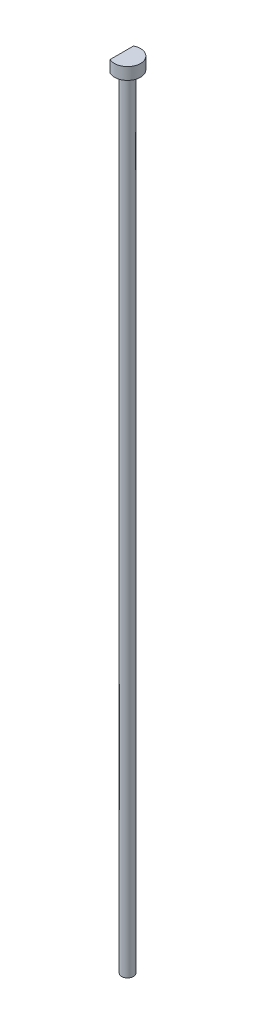
ISO-10303-21;
HEADER;
FILE_DESCRIPTION(('STEP AP214'),'2;1');
FILE_NAME('part.step','',(''),(''),'','','');
FILE_SCHEMA(('AUTOMOTIVE_DESIGN { 1 0 10303 214 1 1 1 1 }'));
ENDSEC;
DATA;
#1=APPLICATION_CONTEXT('core data for automotive mechanical design processes');
#2=APPLICATION_PROTOCOL_DEFINITION('international standard','automotive_design',2000,#1);
#3=PRODUCT_CONTEXT('',#1,'mechanical');
#4=PRODUCT('Part','Part','',(#3));
#5=PRODUCT_RELATED_PRODUCT_CATEGORY('part','',(#4));
#6=PRODUCT_DEFINITION_FORMATION('','',#4);
#7=PRODUCT_DEFINITION_CONTEXT('part definition',#1,'design');
#8=PRODUCT_DEFINITION('design','',#6,#7);
#9=PRODUCT_DEFINITION_SHAPE('','',#8);
#10=(LENGTH_UNIT() NAMED_UNIT(*) SI_UNIT(.MILLI.,.METRE.));
#11=(NAMED_UNIT(*) PLANE_ANGLE_UNIT() SI_UNIT($,.RADIAN.));
#12=(NAMED_UNIT(*) SI_UNIT($,.STERADIAN.) SOLID_ANGLE_UNIT());
#13=UNCERTAINTY_MEASURE_WITH_UNIT(LENGTH_MEASURE(1.E-05),#10,'distance_accuracy_value','');
#14=(GEOMETRIC_REPRESENTATION_CONTEXT(3) GLOBAL_UNCERTAINTY_ASSIGNED_CONTEXT((#13)) GLOBAL_UNIT_ASSIGNED_CONTEXT((#10,
#11,#12)) REPRESENTATION_CONTEXT('',''));
#15=CARTESIAN_POINT('',(0.,0.,0.));
#16=DIRECTION('',(0.,0.,1.));
#17=DIRECTION('',(1.,0.,0.));
#18=AXIS2_PLACEMENT_3D('',#15,#16,#17);
#19=CARTESIAN_POINT('',(74.9720896996677,-2.,-66.1181306724391));
#20=DIRECTION('',(0.,1.,0.));
#21=DIRECTION('',(0.,0.,1.));
#22=AXIS2_PLACEMENT_3D('',#19,#20,#21);
#23=PLANE('',#22);
#24=DIRECTION('',(0.,0.,1.));
#25=VECTOR('',#24,1.);
#26=CARTESIAN_POINT('',(71.0780888071205,-2.,-70.9771390194246));
#27=LINE('',#26,#25);
#28=CARTESIAN_POINT('',(71.0780888071205,-2.,-61.2591223254536));
#29=VERTEX_POINT('',#28);
#30=CARTESIAN_POINT('',(71.0780888071205,-2.,-70.9771390194246));
#31=VERTEX_POINT('',#30);
#32=EDGE_CURVE('E64',#29,#31,#27,.F.);
#33=ORIENTED_EDGE('',*,*,#32,.F.);
#34=CARTESIAN_POINT('',(73.4562989507967,-2.,-66.1181306724391));
#35=DIRECTION('',(0.,1.,0.));
#36=DIRECTION('',(0.,0.,1.));
#37=AXIS2_PLACEMENT_3D('',#34,#35,#36);
#38=CIRCLE('',#37,5.40979164141828);
#39=EDGE_CURVE('E19',#31,#29,#38,.F.);
#40=ORIENTED_EDGE('',*,*,#39,.F.);
#41=EDGE_LOOP('',(#33,#40));
#42=FACE_BOUND('',#41,.T.);
#43=ADVANCED_FACE('F16',(#42),#23,.T.);
#44=CARTESIAN_POINT('',(73.4562989507967,-7.,-66.1181306724391));
#45=DIRECTION('',(0.,1.,0.));
#46=DIRECTION('',(0.,0.,1.));
#47=AXIS2_PLACEMENT_3D('',#44,#45,#46);
#48=CYLINDRICAL_SURFACE('',#47,5.40979164141828);
#49=ORIENTED_EDGE('',*,*,#39,.T.);
#50=DIRECTION('',(0.,1.,0.));
#51=VECTOR('',#50,1.);
#52=CARTESIAN_POINT('',(71.0780888071205,-7.,-61.2591223254536));
#53=LINE('',#52,#51);
#54=CARTESIAN_POINT('',(71.0780888071205,-7.,-61.2591223254536));
#55=VERTEX_POINT('',#54);
#56=EDGE_CURVE('E58',#55,#29,#53,.T.);
#57=ORIENTED_EDGE('',*,*,#56,.F.);
#58=CARTESIAN_POINT('',(73.4562989507967,-7.,-66.1181306724391));
#59=DIRECTION('',(0.,1.,0.));
#60=DIRECTION('',(0.,0.,1.));
#61=AXIS2_PLACEMENT_3D('',#58,#59,#60);
#62=CIRCLE('',#61,5.40979164141828);
#63=CARTESIAN_POINT('',(71.0780888071205,-7.,-70.9771390194246));
#64=VERTEX_POINT('',#63);
#65=EDGE_CURVE('E63',#55,#64,#62,.T.);
#66=ORIENTED_EDGE('',*,*,#65,.T.);
#67=DIRECTION('',(0.,1.,0.));
#68=VECTOR('',#67,1.);
#69=CARTESIAN_POINT('',(71.0780888071205,-7.,-70.9771390194246));
#70=LINE('',#69,#68);
#71=EDGE_CURVE('E61',#31,#64,#70,.F.);
#72=ORIENTED_EDGE('',*,*,#71,.F.);
#73=EDGE_LOOP('',(#49,#57,#66,#72));
#74=FACE_BOUND('',#73,.T.);
#75=ADVANCED_FACE('F56',(#74),#48,.T.);
#76=CARTESIAN_POINT('',(74.9720896996677,-7.,-66.1181306724391));
#77=DIRECTION('',(0.,1.,0.));
#78=DIRECTION('',(0.,0.,1.));
#79=AXIS2_PLACEMENT_3D('',#76,#77,#78);
#80=PLANE('',#79);
#81=DIRECTION('',(0.,0.,1.));
#82=VECTOR('',#81,1.);
#83=CARTESIAN_POINT('',(71.0780888071205,-7.,-70.9771390194246));
#84=LINE('',#83,#82);
#85=CARTESIAN_POINT('',(71.0780888071205,-7.,-66.7089493946506));
#86=VERTEX_POINT('',#85);
#87=EDGE_CURVE('E73',#64,#86,#84,.T.);
#88=ORIENTED_EDGE('',*,*,#87,.F.);
#89=ORIENTED_EDGE('',*,*,#65,.F.);
#90=DIRECTION('',(0.,0.,1.));
#91=VECTOR('',#90,1.);
#92=CARTESIAN_POINT('',(71.0780888071205,-7.,-70.9771390194246));
#93=LINE('',#92,#91);
#94=CARTESIAN_POINT('',(71.0780888071205,-7.,-65.5273119502276));
#95=VERTEX_POINT('',#94);
#96=EDGE_CURVE('E69',#95,#55,#93,.T.);
#97=ORIENTED_EDGE('',*,*,#96,.F.);
#98=CARTESIAN_POINT('',(73.4562989507967,-7.,-66.1181306724391));
#99=DIRECTION('',(0.,-1.,0.));
#100=DIRECTION('',(0.,0.,-1.));
#101=AXIS2_PLACEMENT_3D('',#98,#99,#100);
#102=CIRCLE('',#101,2.4505);
#103=EDGE_CURVE('E76',#86,#95,#102,.T.);
#104=ORIENTED_EDGE('',*,*,#103,.F.);
#105=EDGE_LOOP('',(#88,#89,#97,#104));
#106=FACE_BOUND('',#105,.T.);
#107=ADVANCED_FACE('F89',(#106),#80,.F.);
#108=CARTESIAN_POINT('',(73.4578188789586,-333.5,-66.1181306724391));
#109=DIRECTION('',(0.,1.,0.));
#110=DIRECTION('',(0.,0.,1.));
#111=AXIS2_PLACEMENT_3D('',#108,#109,#110);
#112=PLANE('',#111);
#113=DIRECTION('',(0.,0.,1.));
#114=VECTOR('',#113,1.);
#115=CARTESIAN_POINT('',(71.0780888071205,-333.5,-70.9771390194246));
#116=LINE('',#115,#114);
#117=CARTESIAN_POINT('',(71.0780888071205,-333.5,-66.7089493946506));
#118=VERTEX_POINT('',#117);
#119=CARTESIAN_POINT('',(71.0780888071205,-333.5,-65.5273119502276));
#120=VERTEX_POINT('',#119);
#121=EDGE_CURVE('E33',#118,#120,#116,.T.);
#122=ORIENTED_EDGE('',*,*,#121,.F.);
#123=CARTESIAN_POINT('',(73.4562989507967,-333.5,-66.1181306724391));
#124=DIRECTION('',(0.,-1.,0.));
#125=DIRECTION('',(0.,0.,-1.));
#126=AXIS2_PLACEMENT_3D('',#123,#124,#125);
#127=CIRCLE('',#126,2.4505);
#128=EDGE_CURVE('E25',#120,#118,#127,.F.);
#129=ORIENTED_EDGE('',*,*,#128,.F.);
#130=EDGE_LOOP('',(#122,#129));
#131=FACE_BOUND('',#130,.T.);
#132=ADVANCED_FACE('F91',(#131),#112,.F.);
#133=CARTESIAN_POINT('',(71.0780888071205,-7.,-70.9771390194246));
#134=DIRECTION('',(-1.,0.,0.));
#135=DIRECTION('',(0.,0.,1.));
#136=AXIS2_PLACEMENT_3D('',#133,#134,#135);
#137=PLANE('',#136);
#138=ORIENTED_EDGE('',*,*,#32,.T.);
#139=ORIENTED_EDGE('',*,*,#71,.T.);
#140=ORIENTED_EDGE('',*,*,#87,.T.);
#141=DIRECTION('',(0.,-1.,0.));
#142=VECTOR('',#141,1.);
#143=CARTESIAN_POINT('',(71.0780888071205,-7.,-66.7089493946505));
#144=LINE('',#143,#142);
#145=EDGE_CURVE('E11',#118,#86,#144,.F.);
#146=ORIENTED_EDGE('',*,*,#145,.F.);
#147=ORIENTED_EDGE('',*,*,#121,.T.);
#148=DIRECTION('',(0.,-1.,0.));
#149=VECTOR('',#148,1.);
#150=CARTESIAN_POINT('',(71.0780888071205,-7.,-65.5273119502276));
#151=LINE('',#150,#149);
#152=EDGE_CURVE('E79',#95,#120,#151,.T.);
#153=ORIENTED_EDGE('',*,*,#152,.F.);
#154=ORIENTED_EDGE('',*,*,#96,.T.);
#155=ORIENTED_EDGE('',*,*,#56,.T.);
#156=EDGE_LOOP('',(#138,#139,#140,#146,#147,#153,#154,#155));
#157=FACE_BOUND('',#156,.T.);
#158=ADVANCED_FACE('F67',(#157),#137,.T.);
#159=CARTESIAN_POINT('',(73.4562989507967,-7.,-66.1181306724391));
#160=DIRECTION('',(0.,-1.,0.));
#161=DIRECTION('',(0.,0.,-1.));
#162=AXIS2_PLACEMENT_3D('',#159,#160,#161);
#163=CYLINDRICAL_SURFACE('',#162,2.4505);
#164=ORIENTED_EDGE('',*,*,#128,.T.);
#165=ORIENTED_EDGE('',*,*,#145,.T.);
#166=ORIENTED_EDGE('',*,*,#103,.T.);
#167=ORIENTED_EDGE('',*,*,#152,.T.);
#168=EDGE_LOOP('',(#164,#165,#166,#167));
#169=FACE_BOUND('',#168,.T.);
#170=ADVANCED_FACE('F87',(#169),#163,.T.);
#171=CLOSED_SHELL('',(#43,#75,#107,#132,#158,#170));
#172=MANIFOLD_SOLID_BREP('B1',#171);
#173=ADVANCED_BREP_SHAPE_REPRESENTATION('',(#18,#172),#14);
#174=SHAPE_DEFINITION_REPRESENTATION(#9,#173);
ENDSEC;
END-ISO-10303-21;
